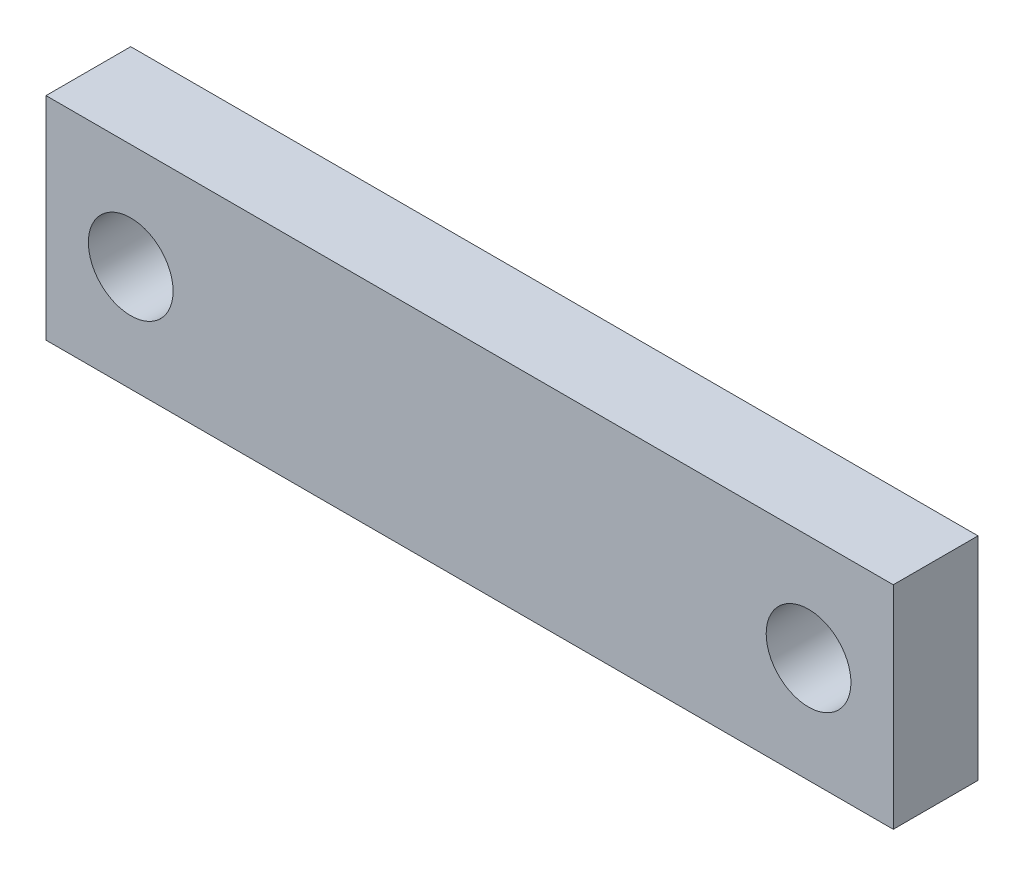
ISO-10303-21;
HEADER;
FILE_DESCRIPTION(('STEP AP214'),'2;1');
FILE_NAME('part.step','',(''),(''),'','','');
FILE_SCHEMA(('AUTOMOTIVE_DESIGN { 1 0 10303 214 1 1 1 1 }'));
ENDSEC;
DATA;
#1=APPLICATION_CONTEXT('core data for automotive mechanical design processes');
#2=APPLICATION_PROTOCOL_DEFINITION('international standard','automotive_design',2000,#1);
#3=PRODUCT_CONTEXT('',#1,'mechanical');
#4=PRODUCT('Part','Part','',(#3));
#5=PRODUCT_RELATED_PRODUCT_CATEGORY('part','',(#4));
#6=PRODUCT_DEFINITION_FORMATION('','',#4);
#7=PRODUCT_DEFINITION_CONTEXT('part definition',#1,'design');
#8=PRODUCT_DEFINITION('design','',#6,#7);
#9=PRODUCT_DEFINITION_SHAPE('','',#8);
#10=(LENGTH_UNIT() NAMED_UNIT(*) SI_UNIT(.MILLI.,.METRE.));
#11=(NAMED_UNIT(*) PLANE_ANGLE_UNIT() SI_UNIT($,.RADIAN.));
#12=(NAMED_UNIT(*) SI_UNIT($,.STERADIAN.) SOLID_ANGLE_UNIT());
#13=UNCERTAINTY_MEASURE_WITH_UNIT(LENGTH_MEASURE(1.E-05),#10,'distance_accuracy_value','');
#14=(GEOMETRIC_REPRESENTATION_CONTEXT(3) GLOBAL_UNCERTAINTY_ASSIGNED_CONTEXT((#13)) GLOBAL_UNIT_ASSIGNED_CONTEXT((#10,
#11,#12)) REPRESENTATION_CONTEXT('',''));
#15=CARTESIAN_POINT('',(0.,0.,0.));
#16=DIRECTION('',(0.,0.,1.));
#17=DIRECTION('',(1.,0.,0.));
#18=AXIS2_PLACEMENT_3D('',#15,#16,#17);
#19=CARTESIAN_POINT('',(0.,0.,2.));
#20=DIRECTION('',(0.,0.,1.));
#21=DIRECTION('',(1.,0.,0.));
#22=AXIS2_PLACEMENT_3D('',#19,#20,#21);
#23=PLANE('',#22);
#24=CARTESIAN_POINT('',(-8.,0.,2.));
#25=DIRECTION('',(0.,0.,1.));
#26=DIRECTION('',(1.,0.,0.));
#27=AXIS2_PLACEMENT_3D('',#24,#25,#26);
#28=CIRCLE('',#27,0.999999999999998);
#29=CARTESIAN_POINT('',(-7.,0.,2.));
#30=VERTEX_POINT('',#29);
#31=EDGE_CURVE('E99',#30,#30,#28,.T.);
#32=ORIENTED_EDGE('',*,*,#31,.F.);
#33=EDGE_LOOP('',(#32));
#34=FACE_BOUND('',#33,.T.);
#35=DIRECTION('',(0.,1.,0.));
#36=VECTOR('',#35,1.);
#37=CARTESIAN_POINT('',(10.,2.5,2.));
#38=LINE('',#37,#36);
#39=CARTESIAN_POINT('',(10.,-2.5,2.));
#40=VERTEX_POINT('',#39);
#41=CARTESIAN_POINT('',(10.,2.5,2.));
#42=VERTEX_POINT('',#41);
#43=EDGE_CURVE('E84',#40,#42,#38,.T.);
#44=ORIENTED_EDGE('',*,*,#43,.T.);
#45=DIRECTION('',(-1.,0.,0.));
#46=VECTOR('',#45,1.);
#47=CARTESIAN_POINT('',(-10.,2.5,2.));
#48=LINE('',#47,#46);
#49=CARTESIAN_POINT('',(-10.,2.5,2.));
#50=VERTEX_POINT('',#49);
#51=EDGE_CURVE('E79',#42,#50,#48,.T.);
#52=ORIENTED_EDGE('',*,*,#51,.T.);
#53=DIRECTION('',(0.,-1.,0.));
#54=VECTOR('',#53,1.);
#55=CARTESIAN_POINT('',(-10.,2.5,2.));
#56=LINE('',#55,#54);
#57=CARTESIAN_POINT('',(-10.,-2.5,2.));
#58=VERTEX_POINT('',#57);
#59=EDGE_CURVE('E82',#50,#58,#56,.T.);
#60=ORIENTED_EDGE('',*,*,#59,.T.);
#61=DIRECTION('',(1.,0.,0.));
#62=VECTOR('',#61,1.);
#63=CARTESIAN_POINT('',(-10.,-2.5,2.));
#64=LINE('',#63,#62);
#65=EDGE_CURVE('E49',#58,#40,#64,.T.);
#66=ORIENTED_EDGE('',*,*,#65,.T.);
#67=EDGE_LOOP('',(#44,#52,#60,#66));
#68=FACE_BOUND('',#67,.T.);
#69=CARTESIAN_POINT('',(8.,0.,2.));
#70=DIRECTION('',(0.,0.,1.));
#71=DIRECTION('',(-1.,0.,0.));
#72=AXIS2_PLACEMENT_3D('',#69,#70,#71);
#73=CIRCLE('',#72,0.999999999999998);
#74=CARTESIAN_POINT('',(7.,0.,2.));
#75=VERTEX_POINT('',#74);
#76=EDGE_CURVE('E114',#75,#75,#73,.T.);
#77=ORIENTED_EDGE('',*,*,#76,.F.);
#78=EDGE_LOOP('',(#77));
#79=FACE_BOUND('',#78,.T.);
#80=ADVANCED_FACE('F32',(#34,#68,#79),#23,.T.);
#81=CARTESIAN_POINT('',(0.,0.,0.));
#82=DIRECTION('',(0.,0.,1.));
#83=DIRECTION('',(1.,0.,0.));
#84=AXIS2_PLACEMENT_3D('',#81,#82,#83);
#85=PLANE('',#84);
#86=DIRECTION('',(0.,1.,0.));
#87=VECTOR('',#86,1.);
#88=CARTESIAN_POINT('',(10.,2.5,0.));
#89=LINE('',#88,#87);
#90=CARTESIAN_POINT('',(10.,-2.5,0.));
#91=VERTEX_POINT('',#90);
#92=CARTESIAN_POINT('',(10.,2.5,0.));
#93=VERTEX_POINT('',#92);
#94=EDGE_CURVE('E96',#91,#93,#89,.T.);
#95=ORIENTED_EDGE('',*,*,#94,.F.);
#96=DIRECTION('',(1.,0.,0.));
#97=VECTOR('',#96,1.);
#98=CARTESIAN_POINT('',(-10.,-2.5,0.));
#99=LINE('',#98,#97);
#100=CARTESIAN_POINT('',(-10.,-2.5,0.));
#101=VERTEX_POINT('',#100);
#102=EDGE_CURVE('E72',#101,#91,#99,.T.);
#103=ORIENTED_EDGE('',*,*,#102,.F.);
#104=DIRECTION('',(0.,-1.,0.));
#105=VECTOR('',#104,1.);
#106=CARTESIAN_POINT('',(-10.,2.5,0.));
#107=LINE('',#106,#105);
#108=CARTESIAN_POINT('',(-10.,2.5,0.));
#109=VERTEX_POINT('',#108);
#110=EDGE_CURVE('E66',#109,#101,#107,.T.);
#111=ORIENTED_EDGE('',*,*,#110,.F.);
#112=DIRECTION('',(-1.,0.,0.));
#113=VECTOR('',#112,1.);
#114=CARTESIAN_POINT('',(-10.,2.5,0.));
#115=LINE('',#114,#113);
#116=EDGE_CURVE('E88',#93,#109,#115,.T.);
#117=ORIENTED_EDGE('',*,*,#116,.F.);
#118=EDGE_LOOP('',(#95,#103,#111,#117));
#119=FACE_BOUND('',#118,.T.);
#120=CARTESIAN_POINT('',(-8.,0.,0.));
#121=DIRECTION('',(0.,0.,1.));
#122=DIRECTION('',(1.,0.,0.));
#123=AXIS2_PLACEMENT_3D('',#120,#121,#122);
#124=CIRCLE('',#123,0.999999999999998);
#125=CARTESIAN_POINT('',(-7.,0.,0.));
#126=VERTEX_POINT('',#125);
#127=EDGE_CURVE('E111',#126,#126,#124,.T.);
#128=ORIENTED_EDGE('',*,*,#127,.T.);
#129=EDGE_LOOP('',(#128));
#130=FACE_BOUND('',#129,.T.);
#131=CARTESIAN_POINT('',(8.,0.,0.));
#132=DIRECTION('',(0.,0.,1.));
#133=DIRECTION('',(-1.,0.,0.));
#134=AXIS2_PLACEMENT_3D('',#131,#132,#133);
#135=CIRCLE('',#134,0.999999999999998);
#136=CARTESIAN_POINT('',(7.,0.,0.));
#137=VERTEX_POINT('',#136);
#138=EDGE_CURVE('E117',#137,#137,#135,.T.);
#139=ORIENTED_EDGE('',*,*,#138,.T.);
#140=EDGE_LOOP('',(#139));
#141=FACE_BOUND('',#140,.T.);
#142=ADVANCED_FACE('F107',(#119,#130,#141),#85,.F.);
#143=CARTESIAN_POINT('',(10.,2.5,2.));
#144=DIRECTION('',(-1.,0.,0.));
#145=DIRECTION('',(0.,-1.,0.));
#146=AXIS2_PLACEMENT_3D('',#143,#144,#145);
#147=PLANE('',#146);
#148=ORIENTED_EDGE('',*,*,#94,.T.);
#149=DIRECTION('',(0.,0.,-1.));
#150=VECTOR('',#149,1.);
#151=CARTESIAN_POINT('',(10.,2.5,2.));
#152=LINE('',#151,#150);
#153=EDGE_CURVE('E11',#42,#93,#152,.T.);
#154=ORIENTED_EDGE('',*,*,#153,.F.);
#155=ORIENTED_EDGE('',*,*,#43,.F.);
#156=DIRECTION('',(0.,0.,-1.));
#157=VECTOR('',#156,1.);
#158=CARTESIAN_POINT('',(10.,-2.5,2.));
#159=LINE('',#158,#157);
#160=EDGE_CURVE('E92',#40,#91,#159,.T.);
#161=ORIENTED_EDGE('',*,*,#160,.T.);
#162=EDGE_LOOP('',(#148,#154,#155,#161));
#163=FACE_BOUND('',#162,.T.);
#164=ADVANCED_FACE('F34',(#163),#147,.F.);
#165=CARTESIAN_POINT('',(-10.,2.5,2.));
#166=DIRECTION('',(0.,-1.,0.));
#167=DIRECTION('',(1.,0.,0.));
#168=AXIS2_PLACEMENT_3D('',#165,#166,#167);
#169=PLANE('',#168);
#170=ORIENTED_EDGE('',*,*,#116,.T.);
#171=DIRECTION('',(0.,0.,-1.));
#172=VECTOR('',#171,1.);
#173=CARTESIAN_POINT('',(-10.,2.5,2.));
#174=LINE('',#173,#172);
#175=EDGE_CURVE('E41',#50,#109,#174,.T.);
#176=ORIENTED_EDGE('',*,*,#175,.F.);
#177=ORIENTED_EDGE('',*,*,#51,.F.);
#178=ORIENTED_EDGE('',*,*,#153,.T.);
#179=EDGE_LOOP('',(#170,#176,#177,#178));
#180=FACE_BOUND('',#179,.T.);
#181=ADVANCED_FACE('F87',(#180),#169,.F.);
#182=CARTESIAN_POINT('',(-10.,2.5,2.));
#183=DIRECTION('',(1.,0.,0.));
#184=DIRECTION('',(0.,0.,-1.));
#185=AXIS2_PLACEMENT_3D('',#182,#183,#184);
#186=PLANE('',#185);
#187=ORIENTED_EDGE('',*,*,#110,.T.);
#188=DIRECTION('',(0.,0.,-1.));
#189=VECTOR('',#188,1.);
#190=CARTESIAN_POINT('',(-10.,-2.5,2.));
#191=LINE('',#190,#189);
#192=EDGE_CURVE('E89',#58,#101,#191,.T.);
#193=ORIENTED_EDGE('',*,*,#192,.F.);
#194=ORIENTED_EDGE('',*,*,#59,.F.);
#195=ORIENTED_EDGE('',*,*,#175,.T.);
#196=EDGE_LOOP('',(#187,#193,#194,#195));
#197=FACE_BOUND('',#196,.T.);
#198=ADVANCED_FACE('F90',(#197),#186,.F.);
#199=CARTESIAN_POINT('',(-10.,-2.5,2.));
#200=DIRECTION('',(0.,1.,0.));
#201=DIRECTION('',(-1.,0.,0.));
#202=AXIS2_PLACEMENT_3D('',#199,#200,#201);
#203=PLANE('',#202);
#204=ORIENTED_EDGE('',*,*,#102,.T.);
#205=ORIENTED_EDGE('',*,*,#160,.F.);
#206=ORIENTED_EDGE('',*,*,#65,.F.);
#207=ORIENTED_EDGE('',*,*,#192,.T.);
#208=EDGE_LOOP('',(#204,#205,#206,#207));
#209=FACE_BOUND('',#208,.T.);
#210=ADVANCED_FACE('F104',(#209),#203,.F.);
#211=CARTESIAN_POINT('',(-8.,0.,2.));
#212=DIRECTION('',(0.,0.,-1.));
#213=DIRECTION('',(-1.,0.,0.));
#214=AXIS2_PLACEMENT_3D('',#211,#212,#213);
#215=CYLINDRICAL_SURFACE('',#214,0.999999999999998);
#216=ORIENTED_EDGE('',*,*,#31,.T.);
#217=EDGE_LOOP('',(#216));
#218=FACE_BOUND('',#217,.T.);
#219=ORIENTED_EDGE('',*,*,#127,.F.);
#220=EDGE_LOOP('',(#219));
#221=FACE_BOUND('',#220,.T.);
#222=ADVANCED_FACE('F134',(#218,#221),#215,.F.);
#223=CARTESIAN_POINT('',(8.,0.,2.));
#224=DIRECTION('',(0.,0.,-1.));
#225=DIRECTION('',(-1.,0.,0.));
#226=AXIS2_PLACEMENT_3D('',#223,#224,#225);
#227=CYLINDRICAL_SURFACE('',#226,0.999999999999998);
#228=ORIENTED_EDGE('',*,*,#76,.T.);
#229=EDGE_LOOP('',(#228));
#230=FACE_BOUND('',#229,.T.);
#231=ORIENTED_EDGE('',*,*,#138,.F.);
#232=EDGE_LOOP('',(#231));
#233=FACE_BOUND('',#232,.T.);
#234=ADVANCED_FACE('F123',(#230,#233),#227,.F.);
#235=CLOSED_SHELL('',(#80,#142,#164,#181,#198,#210,#222,#234));
#236=MANIFOLD_SOLID_BREP('B2',#235);
#237=ADVANCED_BREP_SHAPE_REPRESENTATION('',(#18,#236),#14);
#238=SHAPE_DEFINITION_REPRESENTATION(#9,#237);
ENDSEC;
END-ISO-10303-21;
